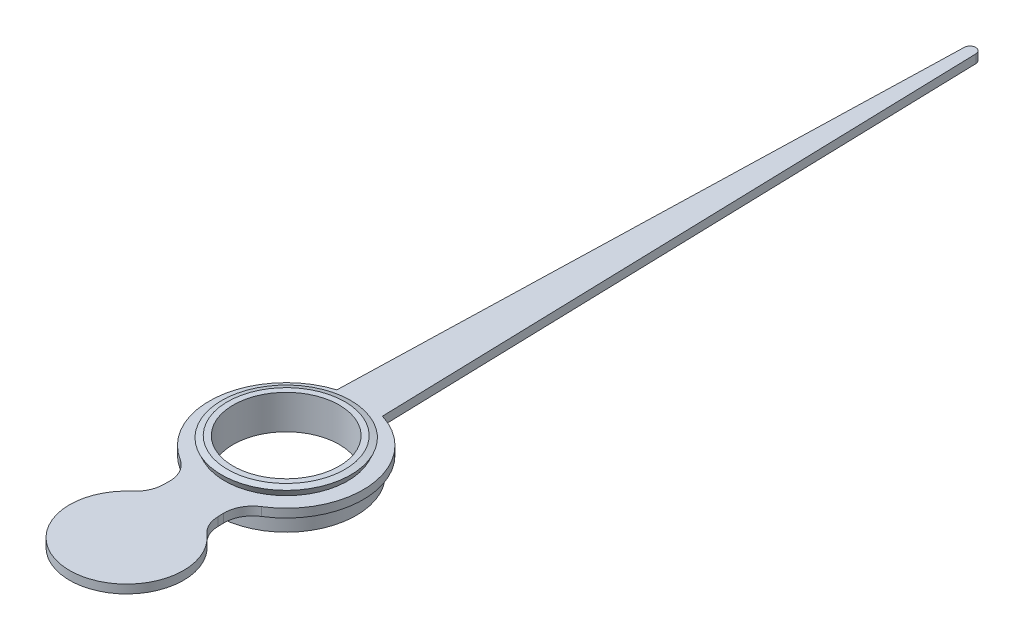
ISO-10303-21;
HEADER;
FILE_DESCRIPTION(('STEP AP214'),'2;1');
FILE_NAME('part.step','',(''),(''),'','','');
FILE_SCHEMA(('AUTOMOTIVE_DESIGN { 1 0 10303 214 1 1 1 1 }'));
ENDSEC;
DATA;
#1=APPLICATION_CONTEXT('core data for automotive mechanical design processes');
#2=APPLICATION_PROTOCOL_DEFINITION('international standard','automotive_design',2000,#1);
#3=PRODUCT_CONTEXT('',#1,'mechanical');
#4=PRODUCT('Part','Part','',(#3));
#5=PRODUCT_RELATED_PRODUCT_CATEGORY('part','',(#4));
#6=PRODUCT_DEFINITION_FORMATION('','',#4);
#7=PRODUCT_DEFINITION_CONTEXT('part definition',#1,'design');
#8=PRODUCT_DEFINITION('design','',#6,#7);
#9=PRODUCT_DEFINITION_SHAPE('','',#8);
#10=(LENGTH_UNIT() NAMED_UNIT(*) SI_UNIT(.MILLI.,.METRE.));
#11=(NAMED_UNIT(*) PLANE_ANGLE_UNIT() SI_UNIT($,.RADIAN.));
#12=(NAMED_UNIT(*) SI_UNIT($,.STERADIAN.) SOLID_ANGLE_UNIT());
#13=UNCERTAINTY_MEASURE_WITH_UNIT(LENGTH_MEASURE(1.E-05),#10,'distance_accuracy_value','');
#14=(GEOMETRIC_REPRESENTATION_CONTEXT(3) GLOBAL_UNCERTAINTY_ASSIGNED_CONTEXT((#13)) GLOBAL_UNIT_ASSIGNED_CONTEXT((#10,
#11,#12)) REPRESENTATION_CONTEXT('',''));
#15=CARTESIAN_POINT('',(0.,0.,0.));
#16=DIRECTION('',(0.,0.,1.));
#17=DIRECTION('',(1.,0.,0.));
#18=AXIS2_PLACEMENT_3D('',#15,#16,#17);
#19=CARTESIAN_POINT('',(-0.93,0.,0.));
#20=DIRECTION('',(0.,1.,0.));
#21=DIRECTION('',(0.,0.,1.));
#22=AXIS2_PLACEMENT_3D('',#19,#20,#21);
#23=PLANE('',#22);
#24=CARTESIAN_POINT('',(0.,0.,0.));
#25=DIRECTION('',(0.,-1.,0.));
#26=DIRECTION('',(0.,0.,-1.));
#27=AXIS2_PLACEMENT_3D('',#24,#25,#26);
#28=CIRCLE('',#27,0.93);
#29=CARTESIAN_POINT('',(0.,0.,-0.93));
#30=VERTEX_POINT('',#29);
#31=EDGE_CURVE('E210',#30,#30,#28,.T.);
#32=ORIENTED_EDGE('',*,*,#31,.F.);
#33=EDGE_LOOP('',(#32));
#34=FACE_BOUND('',#33,.T.);
#35=CARTESIAN_POINT('',(0.,0.,0.));
#36=DIRECTION('',(0.,-1.,0.));
#37=DIRECTION('',(0.,0.,-1.));
#38=AXIS2_PLACEMENT_3D('',#35,#36,#37);
#39=CIRCLE('',#38,1.23);
#40=CARTESIAN_POINT('',(0.,0.,-1.23));
#41=VERTEX_POINT('',#40);
#42=EDGE_CURVE('E12',#41,#41,#39,.T.);
#43=ORIENTED_EDGE('',*,*,#42,.T.);
#44=EDGE_LOOP('',(#43));
#45=FACE_BOUND('',#44,.T.);
#46=ADVANCED_FACE('F36',(#34,#45),#23,.F.);
#47=CARTESIAN_POINT('',(0.,0.,0.));
#48=DIRECTION('',(0.,-1.,0.));
#49=DIRECTION('',(0.,0.,-1.));
#50=AXIS2_PLACEMENT_3D('',#47,#48,#49);
#51=CYLINDRICAL_SURFACE('',#50,1.23);
#52=ORIENTED_EDGE('',*,*,#42,.F.);
#53=EDGE_LOOP('',(#52));
#54=FACE_BOUND('',#53,.T.);
#55=CARTESIAN_POINT('',(0.,0.3,0.));
#56=DIRECTION('',(0.,1.,0.));
#57=DIRECTION('',(0.,0.,1.));
#58=AXIS2_PLACEMENT_3D('',#55,#56,#57);
#59=CIRCLE('',#58,1.23);
#60=CARTESIAN_POINT('',(0.,0.3,1.23));
#61=VERTEX_POINT('',#60);
#62=EDGE_CURVE('E207',#61,#61,#59,.T.);
#63=ORIENTED_EDGE('',*,*,#62,.F.);
#64=EDGE_LOOP('',(#63));
#65=FACE_BOUND('',#64,.T.);
#66=ADVANCED_FACE('F228',(#54,#65),#51,.T.);
#67=CARTESIAN_POINT('',(0.,0.56760309446143,0.));
#68=DIRECTION('',(0.,1.,0.));
#69=DIRECTION('',(0.,0.,1.));
#70=AXIS2_PLACEMENT_3D('',#67,#68,#69);
#71=CONICAL_SURFACE('',#70,1.1324567599348,0.419563540305441);
#72=CARTESIAN_POINT('',(0.,0.45,0.));
#73=DIRECTION('',(0.,-1.,0.));
#74=DIRECTION('',(0.,0.,-1.));
#75=AXIS2_PLACEMENT_3D('',#72,#73,#74);
#76=CIRCLE('',#75,1.08);
#77=CARTESIAN_POINT('',(0.,0.45,-1.08));
#78=VERTEX_POINT('',#77);
#79=EDGE_CURVE('E44',#78,#78,#76,.T.);
#80=ORIENTED_EDGE('',*,*,#79,.F.);
#81=EDGE_LOOP('',(#80));
#82=FACE_BOUND('',#81,.T.);
#83=CARTESIAN_POINT('',(0.,0.56760309446143,0.));
#84=DIRECTION('',(0.,-1.,0.));
#85=DIRECTION('',(0.,0.,-1.));
#86=AXIS2_PLACEMENT_3D('',#83,#84,#85);
#87=CIRCLE('',#86,1.1324567599348);
#88=CARTESIAN_POINT('',(0.,0.56760309446143,-1.1324567599348));
#89=VERTEX_POINT('',#88);
#90=EDGE_CURVE('E219',#89,#89,#87,.T.);
#91=ORIENTED_EDGE('',*,*,#90,.T.);
#92=EDGE_LOOP('',(#91));
#93=FACE_BOUND('',#92,.T.);
#94=ADVANCED_FACE('F224',(#82,#93),#71,.T.);
#95=CARTESIAN_POINT('',(0.,0.6,0.));
#96=DIRECTION('',(0.,-1.,0.));
#97=DIRECTION('',(0.,0.,-1.));
#98=AXIS2_PLACEMENT_3D('',#95,#96,#97);
#99=CONICAL_SURFACE('',#98,1.03010700724817,1.2642429949585);
#100=ORIENTED_EDGE('',*,*,#90,.F.);
#101=EDGE_LOOP('',(#100));
#102=FACE_BOUND('',#101,.T.);
#103=CARTESIAN_POINT('',(0.,0.6,0.));
#104=DIRECTION('',(0.,-1.,0.));
#105=DIRECTION('',(0.,0.,-1.));
#106=AXIS2_PLACEMENT_3D('',#103,#104,#105);
#107=CIRCLE('',#106,1.03010700724817);
#108=CARTESIAN_POINT('',(0.,0.6,-1.03010700724817));
#109=VERTEX_POINT('',#108);
#110=EDGE_CURVE('E216',#109,#109,#107,.T.);
#111=ORIENTED_EDGE('',*,*,#110,.T.);
#112=EDGE_LOOP('',(#111));
#113=FACE_BOUND('',#112,.T.);
#114=ADVANCED_FACE('F227',(#102,#113),#99,.T.);
#115=CARTESIAN_POINT('',(-1.03010700724817,0.6,0.));
#116=DIRECTION('',(0.,-1.,0.));
#117=DIRECTION('',(0.,0.,-1.));
#118=AXIS2_PLACEMENT_3D('',#115,#116,#117);
#119=PLANE('',#118);
#120=ORIENTED_EDGE('',*,*,#110,.F.);
#121=EDGE_LOOP('',(#120));
#122=FACE_BOUND('',#121,.T.);
#123=CARTESIAN_POINT('',(0.,0.6,0.));
#124=DIRECTION('',(0.,-1.,0.));
#125=DIRECTION('',(0.,0.,-1.));
#126=AXIS2_PLACEMENT_3D('',#123,#124,#125);
#127=CIRCLE('',#126,0.93);
#128=CARTESIAN_POINT('',(0.,0.6,-0.93));
#129=VERTEX_POINT('',#128);
#130=EDGE_CURVE('E213',#129,#129,#127,.T.);
#131=ORIENTED_EDGE('',*,*,#130,.T.);
#132=EDGE_LOOP('',(#131));
#133=FACE_BOUND('',#132,.T.);
#134=ADVANCED_FACE('F234',(#122,#133),#119,.F.);
#135=CARTESIAN_POINT('',(0.,0.,0.));
#136=DIRECTION('',(0.,-1.,0.));
#137=DIRECTION('',(0.,0.,-1.));
#138=AXIS2_PLACEMENT_3D('',#135,#136,#137);
#139=CYLINDRICAL_SURFACE('',#138,0.93);
#140=ORIENTED_EDGE('',*,*,#130,.F.);
#141=EDGE_LOOP('',(#140));
#142=FACE_BOUND('',#141,.T.);
#143=ORIENTED_EDGE('',*,*,#31,.T.);
#144=EDGE_LOOP('',(#143));
#145=FACE_BOUND('',#144,.T.);
#146=ADVANCED_FACE('F240',(#142,#145),#139,.F.);
#147=CARTESIAN_POINT('',(0.980246317968713,0.3,1.56895415997689));
#148=DIRECTION('',(0.,1.,0.));
#149=DIRECTION('',(0.,0.,1.));
#150=AXIS2_PLACEMENT_3D('',#147,#148,#149);
#151=PLANE('',#150);
#152=CARTESIAN_POINT('',(0.980246317968713,0.3,1.56895415997689));
#153=DIRECTION('',(0.,-1.,0.));
#154=DIRECTION('',(0.,0.,1.));
#155=AXIS2_PLACEMENT_3D('',#152,#153,#154);
#156=CIRCLE('',#155,0.5);
#157=CARTESIAN_POINT('',(0.480442285607838,0.3,1.58295163245622));
#158=VERTEX_POINT('',#157);
#159=CARTESIAN_POINT('',(0.715314880679872,0.3,1.14491249511827));
#160=VERTEX_POINT('',#159);
#161=EDGE_CURVE('E158',#158,#160,#156,.T.);
#162=ORIENTED_EDGE('',*,*,#161,.F.);
#163=DIRECTION('',(-0.0279949449586743,0.,-0.999608064721749));
#164=VECTOR('',#163,1.);
#165=CARTESIAN_POINT('',(0.483241780103706,0.3,1.6829124389284));
#166=LINE('',#165,#164);
#167=CARTESIAN_POINT('',(0.483241780103706,0.3,1.6829124389284));
#168=VERTEX_POINT('',#167);
#169=EDGE_CURVE('E99',#168,#158,#166,.T.);
#170=ORIENTED_EDGE('',*,*,#169,.F.);
#171=CARTESIAN_POINT('',(0.98304581246458,0.3,1.66891496644906));
#172=DIRECTION('',(0.,-1.,0.));
#173=DIRECTION('',(0.,0.,-1.));
#174=AXIS2_PLACEMENT_3D('',#171,#172,#173);
#175=CIRCLE('',#174,0.5);
#176=CARTESIAN_POINT('',(0.655363874976386,0.3,2.04657161983145));
#177=VERTEX_POINT('',#176);
#178=EDGE_CURVE('E93',#177,#168,#175,.T.);
#179=ORIENTED_EDGE('',*,*,#178,.F.);
#180=CARTESIAN_POINT('',(0.,0.3,2.80188492659622));
#181=DIRECTION('',(0.,1.,0.));
#182=DIRECTION('',(0.,0.,1.));
#183=AXIS2_PLACEMENT_3D('',#180,#181,#182);
#184=CIRCLE('',#183,1.);
#185=CARTESIAN_POINT('',(-0.655363874976387,0.3,2.04657161983145));
#186=VERTEX_POINT('',#185);
#187=EDGE_CURVE('E148',#186,#177,#184,.T.);
#188=ORIENTED_EDGE('',*,*,#187,.F.);
#189=CARTESIAN_POINT('',(-0.98304581246458,0.3,1.66891496644906));
#190=DIRECTION('',(0.,-1.,0.));
#191=DIRECTION('',(0.,0.,1.));
#192=AXIS2_PLACEMENT_3D('',#189,#190,#191);
#193=CIRCLE('',#192,0.5);
#194=CARTESIAN_POINT('',(-0.483241780103706,0.3,1.6829124389284));
#195=VERTEX_POINT('',#194);
#196=EDGE_CURVE('E175',#195,#186,#193,.T.);
#197=ORIENTED_EDGE('',*,*,#196,.F.);
#198=DIRECTION('',(-0.0279949449586743,0.,0.999608064721749));
#199=VECTOR('',#198,1.);
#200=CARTESIAN_POINT('',(-0.480442285607838,0.3,1.58295163245622));
#201=LINE('',#200,#199);
#202=CARTESIAN_POINT('',(-0.480442285607839,0.3,1.58295163245622));
#203=VERTEX_POINT('',#202);
#204=EDGE_CURVE('E173',#203,#195,#201,.T.);
#205=ORIENTED_EDGE('',*,*,#204,.F.);
#206=CARTESIAN_POINT('',(-0.980246317968713,0.3,1.56895415997689));
#207=DIRECTION('',(0.,-1.,0.));
#208=DIRECTION('',(0.,0.,1.));
#209=AXIS2_PLACEMENT_3D('',#206,#207,#208);
#210=CIRCLE('',#209,0.5);
#211=CARTESIAN_POINT('',(-0.715314880679872,0.3,1.14491249511827));
#212=VERTEX_POINT('',#211);
#213=EDGE_CURVE('E171',#212,#203,#210,.T.);
#214=ORIENTED_EDGE('',*,*,#213,.F.);
#215=CARTESIAN_POINT('',(0.,0.3,0.));
#216=DIRECTION('',(0.,1.,0.));
#217=DIRECTION('',(0.,0.,1.));
#218=AXIS2_PLACEMENT_3D('',#215,#216,#217);
#219=CIRCLE('',#218,1.35);
#220=CARTESIAN_POINT('',(-0.4,0.3,-1.28937969582276));
#221=VERTEX_POINT('',#220);
#222=EDGE_CURVE('E169',#221,#212,#219,.T.);
#223=ORIENTED_EDGE('',*,*,#222,.F.);
#224=DIRECTION('',(-0.0279949449586742,0.,0.999608064721749));
#225=VECTOR('',#224,1.);
#226=CARTESIAN_POINT('',(-0.4,0.3,-1.28937969582276));
#227=LINE('',#226,#225);
#228=CARTESIAN_POINT('',(-0.099960806472174,0.3,-12.0027994944959));
#229=VERTEX_POINT('',#228);
#230=EDGE_CURVE('E167',#229,#221,#227,.T.);
#231=ORIENTED_EDGE('',*,*,#230,.F.);
#232=CARTESIAN_POINT('',(0.,0.3,-12.));
#233=DIRECTION('',(0.,1.,0.));
#234=DIRECTION('',(0.,0.,-1.));
#235=AXIS2_PLACEMENT_3D('',#232,#233,#234);
#236=CIRCLE('',#235,0.0999999999999996);
#237=CARTESIAN_POINT('',(0.0999608064721745,0.3,-12.0027994944959));
#238=VERTEX_POINT('',#237);
#239=EDGE_CURVE('E165',#238,#229,#236,.T.);
#240=ORIENTED_EDGE('',*,*,#239,.F.);
#241=DIRECTION('',(-0.0279949449586742,0.,-0.999608064721749));
#242=VECTOR('',#241,1.);
#243=CARTESIAN_POINT('',(0.0999608064721745,0.3,-12.0027994944959));
#244=LINE('',#243,#242);
#245=CARTESIAN_POINT('',(0.4,0.3,-1.28937969582276));
#246=VERTEX_POINT('',#245);
#247=EDGE_CURVE('E163',#246,#238,#244,.T.);
#248=ORIENTED_EDGE('',*,*,#247,.F.);
#249=CARTESIAN_POINT('',(0.,0.3,0.));
#250=DIRECTION('',(0.,1.,0.));
#251=DIRECTION('',(0.,0.,1.));
#252=AXIS2_PLACEMENT_3D('',#249,#250,#251);
#253=CIRCLE('',#252,1.35);
#254=EDGE_CURVE('E161',#160,#246,#253,.T.);
#255=ORIENTED_EDGE('',*,*,#254,.F.);
#256=EDGE_LOOP('',(#162,#170,#179,#188,#197,#205,#214,#223,#231,#240,#248,#255));
#257=FACE_BOUND('',#256,.T.);
#258=ORIENTED_EDGE('',*,*,#62,.T.);
#259=EDGE_LOOP('',(#258));
#260=FACE_BOUND('',#259,.T.);
#261=ADVANCED_FACE('F246',(#257,#260),#151,.F.);
#262=CARTESIAN_POINT('',(0.980246317968713,0.45,1.56895415997689));
#263=DIRECTION('',(0.,1.,0.));
#264=DIRECTION('',(0.,0.,1.));
#265=AXIS2_PLACEMENT_3D('',#262,#263,#264);
#266=PLANE('',#265);
#267=CARTESIAN_POINT('',(0.980246317968713,0.45,1.56895415997689));
#268=DIRECTION('',(0.,-1.,0.));
#269=DIRECTION('',(0.,0.,1.));
#270=AXIS2_PLACEMENT_3D('',#267,#268,#269);
#271=CIRCLE('',#270,0.5);
#272=CARTESIAN_POINT('',(0.480442285607838,0.45,1.58295163245622));
#273=VERTEX_POINT('',#272);
#274=CARTESIAN_POINT('',(0.715314880679872,0.45,1.14491249511827));
#275=VERTEX_POINT('',#274);
#276=EDGE_CURVE('E180',#273,#275,#271,.T.);
#277=ORIENTED_EDGE('',*,*,#276,.T.);
#278=CARTESIAN_POINT('',(0.,0.45,0.));
#279=DIRECTION('',(0.,1.,0.));
#280=DIRECTION('',(0.,0.,1.));
#281=AXIS2_PLACEMENT_3D('',#278,#279,#280);
#282=CIRCLE('',#281,1.35);
#283=CARTESIAN_POINT('',(0.4,0.45,-1.28937969582276));
#284=VERTEX_POINT('',#283);
#285=EDGE_CURVE('E108',#275,#284,#282,.T.);
#286=ORIENTED_EDGE('',*,*,#285,.T.);
#287=DIRECTION('',(-0.0279949449586742,0.,-0.999608064721749));
#288=VECTOR('',#287,1.);
#289=CARTESIAN_POINT('',(0.0999608064721745,0.45,-12.0027994944959));
#290=LINE('',#289,#288);
#291=CARTESIAN_POINT('',(0.0999608064721745,0.45,-12.0027994944959));
#292=VERTEX_POINT('',#291);
#293=EDGE_CURVE('E316',#284,#292,#290,.T.);
#294=ORIENTED_EDGE('',*,*,#293,.T.);
#295=CARTESIAN_POINT('',(0.,0.45,-12.));
#296=DIRECTION('',(0.,1.,0.));
#297=DIRECTION('',(0.,0.,-1.));
#298=AXIS2_PLACEMENT_3D('',#295,#296,#297);
#299=CIRCLE('',#298,0.0999999999999996);
#300=CARTESIAN_POINT('',(-0.099960806472174,0.45,-12.0027994944959));
#301=VERTEX_POINT('',#300);
#302=EDGE_CURVE('E318',#292,#301,#299,.T.);
#303=ORIENTED_EDGE('',*,*,#302,.T.);
#304=DIRECTION('',(-0.0279949449586742,0.,0.999608064721749));
#305=VECTOR('',#304,1.);
#306=CARTESIAN_POINT('',(-0.4,0.45,-1.28937969582276));
#307=LINE('',#306,#305);
#308=CARTESIAN_POINT('',(-0.4,0.45,-1.28937969582276));
#309=VERTEX_POINT('',#308);
#310=EDGE_CURVE('E320',#301,#309,#307,.T.);
#311=ORIENTED_EDGE('',*,*,#310,.T.);
#312=CARTESIAN_POINT('',(0.,0.45,0.));
#313=DIRECTION('',(0.,1.,0.));
#314=DIRECTION('',(0.,0.,1.));
#315=AXIS2_PLACEMENT_3D('',#312,#313,#314);
#316=CIRCLE('',#315,1.35);
#317=CARTESIAN_POINT('',(-0.715314880679872,0.45,1.14491249511827));
#318=VERTEX_POINT('',#317);
#319=EDGE_CURVE('E326',#309,#318,#316,.T.);
#320=ORIENTED_EDGE('',*,*,#319,.T.);
#321=CARTESIAN_POINT('',(-0.980246317968713,0.45,1.56895415997689));
#322=DIRECTION('',(0.,-1.,0.));
#323=DIRECTION('',(0.,0.,1.));
#324=AXIS2_PLACEMENT_3D('',#321,#322,#323);
#325=CIRCLE('',#324,0.5);
#326=CARTESIAN_POINT('',(-0.480442285607839,0.45,1.58295163245622));
#327=VERTEX_POINT('',#326);
#328=EDGE_CURVE('E328',#318,#327,#325,.T.);
#329=ORIENTED_EDGE('',*,*,#328,.T.);
#330=DIRECTION('',(-0.0279949449586743,0.,0.999608064721749));
#331=VECTOR('',#330,1.);
#332=CARTESIAN_POINT('',(-0.480442285607838,0.45,1.58295163245622));
#333=LINE('',#332,#331);
#334=CARTESIAN_POINT('',(-0.483241780103706,0.45,1.6829124389284));
#335=VERTEX_POINT('',#334);
#336=EDGE_CURVE('E330',#327,#335,#333,.T.);
#337=ORIENTED_EDGE('',*,*,#336,.T.);
#338=CARTESIAN_POINT('',(-0.98304581246458,0.45,1.66891496644906));
#339=DIRECTION('',(0.,-1.,0.));
#340=DIRECTION('',(0.,0.,1.));
#341=AXIS2_PLACEMENT_3D('',#338,#339,#340);
#342=CIRCLE('',#341,0.5);
#343=CARTESIAN_POINT('',(-0.655363874976387,0.45,2.04657161983145));
#344=VERTEX_POINT('',#343);
#345=EDGE_CURVE('E140',#335,#344,#342,.T.);
#346=ORIENTED_EDGE('',*,*,#345,.T.);
#347=CARTESIAN_POINT('',(0.,0.45,2.80188492659622));
#348=DIRECTION('',(0.,1.,0.));
#349=DIRECTION('',(0.,0.,1.));
#350=AXIS2_PLACEMENT_3D('',#347,#348,#349);
#351=CIRCLE('',#350,1.);
#352=CARTESIAN_POINT('',(0.655363874976386,0.45,2.04657161983145));
#353=VERTEX_POINT('',#352);
#354=EDGE_CURVE('E133',#344,#353,#351,.T.);
#355=ORIENTED_EDGE('',*,*,#354,.T.);
#356=CARTESIAN_POINT('',(0.98304581246458,0.45,1.66891496644906));
#357=DIRECTION('',(0.,-1.,0.));
#358=DIRECTION('',(0.,0.,-1.));
#359=AXIS2_PLACEMENT_3D('',#356,#357,#358);
#360=CIRCLE('',#359,0.5);
#361=CARTESIAN_POINT('',(0.483241780103706,0.45,1.6829124389284));
#362=VERTEX_POINT('',#361);
#363=EDGE_CURVE('E138',#353,#362,#360,.T.);
#364=ORIENTED_EDGE('',*,*,#363,.T.);
#365=DIRECTION('',(-0.0279949449586743,0.,-0.999608064721749));
#366=VECTOR('',#365,1.);
#367=CARTESIAN_POINT('',(0.483241780103706,0.45,1.6829124389284));
#368=LINE('',#367,#366);
#369=EDGE_CURVE('E52',#362,#273,#368,.T.);
#370=ORIENTED_EDGE('',*,*,#369,.T.);
#371=EDGE_LOOP('',(#277,#286,#294,#303,#311,#320,#329,#337,#346,#355,#364,#370));
#372=FACE_BOUND('',#371,.T.);
#373=ORIENTED_EDGE('',*,*,#79,.T.);
#374=EDGE_LOOP('',(#373));
#375=FACE_BOUND('',#374,.T.);
#376=ADVANCED_FACE('F135',(#372,#375),#266,.T.);
#377=CARTESIAN_POINT('',(0.980246317968713,0.45,1.56895415997689));
#378=DIRECTION('',(0.,-1.,0.));
#379=DIRECTION('',(0.,0.,-1.));
#380=AXIS2_PLACEMENT_3D('',#377,#378,#379);
#381=CYLINDRICAL_SURFACE('',#380,0.5);
#382=ORIENTED_EDGE('',*,*,#161,.T.);
#383=DIRECTION('',(0.,-1.,0.));
#384=VECTOR('',#383,1.);
#385=CARTESIAN_POINT('',(0.715314880679872,0.45,1.14491249511827));
#386=LINE('',#385,#384);
#387=EDGE_CURVE('E205',#275,#160,#386,.T.);
#388=ORIENTED_EDGE('',*,*,#387,.F.);
#389=ORIENTED_EDGE('',*,*,#276,.F.);
#390=DIRECTION('',(0.,-1.,0.));
#391=VECTOR('',#390,1.);
#392=CARTESIAN_POINT('',(0.480442285607838,0.45,1.58295163245622));
#393=LINE('',#392,#391);
#394=EDGE_CURVE('E154',#273,#158,#393,.T.);
#395=ORIENTED_EDGE('',*,*,#394,.T.);
#396=EDGE_LOOP('',(#382,#388,#389,#395));
#397=FACE_BOUND('',#396,.T.);
#398=ADVANCED_FACE('F264',(#397),#381,.F.);
#399=CARTESIAN_POINT('',(0.,0.45,0.));
#400=DIRECTION('',(0.,-1.,0.));
#401=DIRECTION('',(0.,0.,-1.));
#402=AXIS2_PLACEMENT_3D('',#399,#400,#401);
#403=CYLINDRICAL_SURFACE('',#402,1.35);
#404=ORIENTED_EDGE('',*,*,#254,.T.);
#405=DIRECTION('',(0.,-1.,0.));
#406=VECTOR('',#405,1.);
#407=CARTESIAN_POINT('',(0.4,0.45,-1.28937969582276));
#408=LINE('',#407,#406);
#409=EDGE_CURVE('E202',#284,#246,#408,.T.);
#410=ORIENTED_EDGE('',*,*,#409,.F.);
#411=ORIENTED_EDGE('',*,*,#285,.F.);
#412=ORIENTED_EDGE('',*,*,#387,.T.);
#413=EDGE_LOOP('',(#404,#410,#411,#412));
#414=FACE_BOUND('',#413,.T.);
#415=ADVANCED_FACE('F302',(#414),#403,.T.);
#416=CARTESIAN_POINT('',(0.0999608064721745,0.45,-12.0027994944959));
#417=DIRECTION('',(-0.999608064721749,0.,0.0279949449586742));
#418=DIRECTION('',(0.0279949449586742,0.,0.999608064721749));
#419=AXIS2_PLACEMENT_3D('',#416,#417,#418);
#420=PLANE('',#419);
#421=ORIENTED_EDGE('',*,*,#247,.T.);
#422=DIRECTION('',(0.,-1.,0.));
#423=VECTOR('',#422,1.);
#424=CARTESIAN_POINT('',(0.0999608064721745,0.45,-12.0027994944959));
#425=LINE('',#424,#423);
#426=EDGE_CURVE('E199',#292,#238,#425,.T.);
#427=ORIENTED_EDGE('',*,*,#426,.F.);
#428=ORIENTED_EDGE('',*,*,#293,.F.);
#429=ORIENTED_EDGE('',*,*,#409,.T.);
#430=EDGE_LOOP('',(#421,#427,#428,#429));
#431=FACE_BOUND('',#430,.T.);
#432=ADVANCED_FACE('F298',(#431),#420,.F.);
#433=CARTESIAN_POINT('',(0.,0.45,-12.));
#434=DIRECTION('',(0.,-1.,0.));
#435=DIRECTION('',(0.,0.,-1.));
#436=AXIS2_PLACEMENT_3D('',#433,#434,#435);
#437=CYLINDRICAL_SURFACE('',#436,0.0999999999999996);
#438=ORIENTED_EDGE('',*,*,#239,.T.);
#439=DIRECTION('',(0.,-1.,0.));
#440=VECTOR('',#439,1.);
#441=CARTESIAN_POINT('',(-0.099960806472174,0.45,-12.0027994944959));
#442=LINE('',#441,#440);
#443=EDGE_CURVE('E196',#301,#229,#442,.T.);
#444=ORIENTED_EDGE('',*,*,#443,.F.);
#445=ORIENTED_EDGE('',*,*,#302,.F.);
#446=ORIENTED_EDGE('',*,*,#426,.T.);
#447=EDGE_LOOP('',(#438,#444,#445,#446));
#448=FACE_BOUND('',#447,.T.);
#449=ADVANCED_FACE('F294',(#448),#437,.T.);
#450=CARTESIAN_POINT('',(-0.4,0.45,-1.28937969582276));
#451=DIRECTION('',(0.999608064721749,0.,0.0279949449586742));
#452=DIRECTION('',(0.0279949449586742,0.,-0.999608064721749));
#453=AXIS2_PLACEMENT_3D('',#450,#451,#452);
#454=PLANE('',#453);
#455=ORIENTED_EDGE('',*,*,#230,.T.);
#456=DIRECTION('',(0.,-1.,0.));
#457=VECTOR('',#456,1.);
#458=CARTESIAN_POINT('',(-0.4,0.45,-1.28937969582276));
#459=LINE('',#458,#457);
#460=EDGE_CURVE('E193',#309,#221,#459,.T.);
#461=ORIENTED_EDGE('',*,*,#460,.F.);
#462=ORIENTED_EDGE('',*,*,#310,.F.);
#463=ORIENTED_EDGE('',*,*,#443,.T.);
#464=EDGE_LOOP('',(#455,#461,#462,#463));
#465=FACE_BOUND('',#464,.T.);
#466=ADVANCED_FACE('F290',(#465),#454,.F.);
#467=CARTESIAN_POINT('',(0.,0.45,0.));
#468=DIRECTION('',(0.,-1.,0.));
#469=DIRECTION('',(0.,0.,-1.));
#470=AXIS2_PLACEMENT_3D('',#467,#468,#469);
#471=CYLINDRICAL_SURFACE('',#470,1.35);
#472=ORIENTED_EDGE('',*,*,#222,.T.);
#473=DIRECTION('',(0.,-1.,0.));
#474=VECTOR('',#473,1.);
#475=CARTESIAN_POINT('',(-0.715314880679872,0.45,1.14491249511827));
#476=LINE('',#475,#474);
#477=EDGE_CURVE('E190',#318,#212,#476,.T.);
#478=ORIENTED_EDGE('',*,*,#477,.F.);
#479=ORIENTED_EDGE('',*,*,#319,.F.);
#480=ORIENTED_EDGE('',*,*,#460,.T.);
#481=EDGE_LOOP('',(#472,#478,#479,#480));
#482=FACE_BOUND('',#481,.T.);
#483=ADVANCED_FACE('F286',(#482),#471,.T.);
#484=CARTESIAN_POINT('',(-0.980246317968713,0.45,1.56895415997689));
#485=DIRECTION('',(0.,-1.,0.));
#486=DIRECTION('',(0.,0.,-1.));
#487=AXIS2_PLACEMENT_3D('',#484,#485,#486);
#488=CYLINDRICAL_SURFACE('',#487,0.5);
#489=ORIENTED_EDGE('',*,*,#213,.T.);
#490=DIRECTION('',(0.,-1.,0.));
#491=VECTOR('',#490,1.);
#492=CARTESIAN_POINT('',(-0.480442285607839,0.45,1.58295163245622));
#493=LINE('',#492,#491);
#494=EDGE_CURVE('E187',#327,#203,#493,.T.);
#495=ORIENTED_EDGE('',*,*,#494,.F.);
#496=ORIENTED_EDGE('',*,*,#328,.F.);
#497=ORIENTED_EDGE('',*,*,#477,.T.);
#498=EDGE_LOOP('',(#489,#495,#496,#497));
#499=FACE_BOUND('',#498,.T.);
#500=ADVANCED_FACE('F282',(#499),#488,.F.);
#501=CARTESIAN_POINT('',(-0.480442285607838,0.45,1.58295163245622));
#502=DIRECTION('',(0.999608064721749,0.,0.0279949449586743));
#503=DIRECTION('',(0.0279949449586743,0.,-0.999608064721749));
#504=AXIS2_PLACEMENT_3D('',#501,#502,#503);
#505=PLANE('',#504);
#506=ORIENTED_EDGE('',*,*,#204,.T.);
#507=DIRECTION('',(0.,-1.,0.));
#508=VECTOR('',#507,1.);
#509=CARTESIAN_POINT('',(-0.483241780103706,0.45,1.6829124389284));
#510=LINE('',#509,#508);
#511=EDGE_CURVE('E184',#335,#195,#510,.T.);
#512=ORIENTED_EDGE('',*,*,#511,.F.);
#513=ORIENTED_EDGE('',*,*,#336,.F.);
#514=ORIENTED_EDGE('',*,*,#494,.T.);
#515=EDGE_LOOP('',(#506,#512,#513,#514));
#516=FACE_BOUND('',#515,.T.);
#517=ADVANCED_FACE('F278',(#516),#505,.F.);
#518=CARTESIAN_POINT('',(-0.98304581246458,0.45,1.66891496644906));
#519=DIRECTION('',(0.,-1.,0.));
#520=DIRECTION('',(0.,0.,-1.));
#521=AXIS2_PLACEMENT_3D('',#518,#519,#520);
#522=CYLINDRICAL_SURFACE('',#521,0.5);
#523=ORIENTED_EDGE('',*,*,#196,.T.);
#524=DIRECTION('',(0.,-1.,0.));
#525=VECTOR('',#524,1.);
#526=CARTESIAN_POINT('',(-0.655363874976387,0.45,2.04657161983145));
#527=LINE('',#526,#525);
#528=EDGE_CURVE('E149',#344,#186,#527,.T.);
#529=ORIENTED_EDGE('',*,*,#528,.F.);
#530=ORIENTED_EDGE('',*,*,#345,.F.);
#531=ORIENTED_EDGE('',*,*,#511,.T.);
#532=EDGE_LOOP('',(#523,#529,#530,#531));
#533=FACE_BOUND('',#532,.T.);
#534=ADVANCED_FACE('F275',(#533),#522,.F.);
#535=CARTESIAN_POINT('',(0.,0.45,2.80188492659622));
#536=DIRECTION('',(0.,-1.,0.));
#537=DIRECTION('',(0.,0.,-1.));
#538=AXIS2_PLACEMENT_3D('',#535,#536,#537);
#539=CYLINDRICAL_SURFACE('',#538,1.);
#540=ORIENTED_EDGE('',*,*,#187,.T.);
#541=DIRECTION('',(0.,-1.,0.));
#542=VECTOR('',#541,1.);
#543=CARTESIAN_POINT('',(0.655363874976386,0.45,2.04657161983145));
#544=LINE('',#543,#542);
#545=EDGE_CURVE('E145',#353,#177,#544,.T.);
#546=ORIENTED_EDGE('',*,*,#545,.F.);
#547=ORIENTED_EDGE('',*,*,#354,.F.);
#548=ORIENTED_EDGE('',*,*,#528,.T.);
#549=EDGE_LOOP('',(#540,#546,#547,#548));
#550=FACE_BOUND('',#549,.T.);
#551=ADVANCED_FACE('F146',(#550),#539,.T.);
#552=CARTESIAN_POINT('',(0.98304581246458,0.45,1.66891496644906));
#553=DIRECTION('',(0.,-1.,0.));
#554=DIRECTION('',(0.,0.,-1.));
#555=AXIS2_PLACEMENT_3D('',#552,#553,#554);
#556=CYLINDRICAL_SURFACE('',#555,0.5);
#557=ORIENTED_EDGE('',*,*,#178,.T.);
#558=DIRECTION('',(0.,-1.,0.));
#559=VECTOR('',#558,1.);
#560=CARTESIAN_POINT('',(0.483241780103706,0.45,1.6829124389284));
#561=LINE('',#560,#559);
#562=EDGE_CURVE('E150',#362,#168,#561,.T.);
#563=ORIENTED_EDGE('',*,*,#562,.F.);
#564=ORIENTED_EDGE('',*,*,#363,.F.);
#565=ORIENTED_EDGE('',*,*,#545,.T.);
#566=EDGE_LOOP('',(#557,#563,#564,#565));
#567=FACE_BOUND('',#566,.T.);
#568=ADVANCED_FACE('F152',(#567),#556,.F.);
#569=CARTESIAN_POINT('',(0.483241780103706,0.45,1.6829124389284));
#570=DIRECTION('',(-0.999608064721749,0.,0.0279949449586743));
#571=DIRECTION('',(0.0279949449586743,0.,0.999608064721749));
#572=AXIS2_PLACEMENT_3D('',#569,#570,#571);
#573=PLANE('',#572);
#574=ORIENTED_EDGE('',*,*,#169,.T.);
#575=ORIENTED_EDGE('',*,*,#394,.F.);
#576=ORIENTED_EDGE('',*,*,#369,.F.);
#577=ORIENTED_EDGE('',*,*,#562,.T.);
#578=EDGE_LOOP('',(#574,#575,#576,#577));
#579=FACE_BOUND('',#578,.T.);
#580=ADVANCED_FACE('F268',(#579),#573,.F.);
#581=CLOSED_SHELL('',(#46,#66,#94,#114,#134,#146,#261,#376,#398,#415,#432,#449,#466,#483,#500,
#517,#534,#551,#568,#580));
#582=MANIFOLD_SOLID_BREP('B2',#581);
#583=ADVANCED_BREP_SHAPE_REPRESENTATION('',(#18,#582),#14);
#584=SHAPE_DEFINITION_REPRESENTATION(#9,#583);
ENDSEC;
END-ISO-10303-21;
